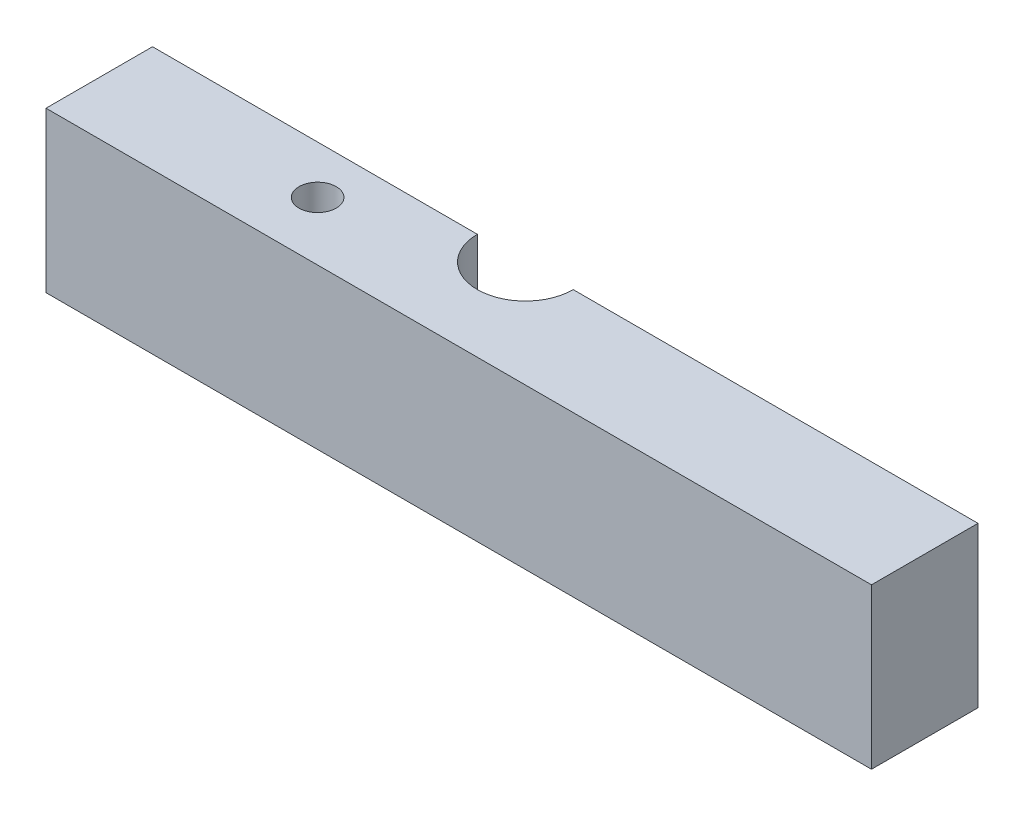
ISO-10303-21;
HEADER;
FILE_DESCRIPTION(('STEP AP214'),'2;1');
FILE_NAME('part.step','',(''),(''),'','','');
FILE_SCHEMA(('AUTOMOTIVE_DESIGN { 1 0 10303 214 1 1 1 1 }'));
ENDSEC;
DATA;
#1=APPLICATION_CONTEXT('core data for automotive mechanical design processes');
#2=APPLICATION_PROTOCOL_DEFINITION('international standard','automotive_design',2000,#1);
#3=PRODUCT_CONTEXT('',#1,'mechanical');
#4=PRODUCT('Part','Part','',(#3));
#5=PRODUCT_RELATED_PRODUCT_CATEGORY('part','',(#4));
#6=PRODUCT_DEFINITION_FORMATION('','',#4);
#7=PRODUCT_DEFINITION_CONTEXT('part definition',#1,'design');
#8=PRODUCT_DEFINITION('design','',#6,#7);
#9=PRODUCT_DEFINITION_SHAPE('','',#8);
#10=(LENGTH_UNIT() NAMED_UNIT(*) SI_UNIT(.MILLI.,.METRE.));
#11=(NAMED_UNIT(*) PLANE_ANGLE_UNIT() SI_UNIT($,.RADIAN.));
#12=(NAMED_UNIT(*) SI_UNIT($,.STERADIAN.) SOLID_ANGLE_UNIT());
#13=UNCERTAINTY_MEASURE_WITH_UNIT(LENGTH_MEASURE(1.E-05),#10,'distance_accuracy_value','');
#14=(GEOMETRIC_REPRESENTATION_CONTEXT(3) GLOBAL_UNCERTAINTY_ASSIGNED_CONTEXT((#13)) GLOBAL_UNIT_ASSIGNED_CONTEXT((#10,
#11,#12)) REPRESENTATION_CONTEXT('',''));
#15=CARTESIAN_POINT('',(0.,0.,0.));
#16=DIRECTION('',(0.,0.,1.));
#17=DIRECTION('',(1.,0.,0.));
#18=AXIS2_PLACEMENT_3D('',#15,#16,#17);
#19=CARTESIAN_POINT('',(0.,30.,0.));
#20=DIRECTION('',(0.,1.,0.));
#21=DIRECTION('',(0.,0.,1.));
#22=AXIS2_PLACEMENT_3D('',#19,#20,#21);
#23=PLANE('',#22);
#24=CARTESIAN_POINT('',(-30.,30.,9.));
#25=DIRECTION('',(0.,-1.,0.));
#26=DIRECTION('',(0.,0.,-1.));
#27=AXIS2_PLACEMENT_3D('',#24,#25,#26);
#28=CIRCLE('',#27,3.5);
#29=CARTESIAN_POINT('',(-30.,30.,5.5));
#30=VERTEX_POINT('',#29);
#31=EDGE_CURVE('E110',#30,#30,#28,.T.);
#32=ORIENTED_EDGE('',*,*,#31,.T.);
#33=EDGE_LOOP('',(#32));
#34=FACE_BOUND('',#33,.T.);
#35=DIRECTION('',(-1.,0.,0.));
#36=VECTOR('',#35,1.);
#37=CARTESIAN_POINT('',(85.,30.,0.));
#38=LINE('',#37,#36);
#39=CARTESIAN_POINT('',(-9.,30.,0.));
#40=VERTEX_POINT('',#39);
#41=CARTESIAN_POINT('',(-70.,30.,0.));
#42=VERTEX_POINT('',#41);
#43=EDGE_CURVE('E64',#40,#42,#38,.T.);
#44=ORIENTED_EDGE('',*,*,#43,.T.);
#45=DIRECTION('',(0.,0.,1.));
#46=VECTOR('',#45,1.);
#47=CARTESIAN_POINT('',(-70.,30.,-20.));
#48=LINE('',#47,#46);
#49=CARTESIAN_POINT('',(-70.,30.,20.));
#50=VERTEX_POINT('',#49);
#51=EDGE_CURVE('E108',#42,#50,#48,.T.);
#52=ORIENTED_EDGE('',*,*,#51,.T.);
#53=DIRECTION('',(1.,0.,0.));
#54=VECTOR('',#53,1.);
#55=CARTESIAN_POINT('',(-70.,30.,20.));
#56=LINE('',#55,#54);
#57=CARTESIAN_POINT('',(85.,30.,20.));
#58=VERTEX_POINT('',#57);
#59=EDGE_CURVE('E156',#50,#58,#56,.T.);
#60=ORIENTED_EDGE('',*,*,#59,.T.);
#61=DIRECTION('',(0.,0.,-1.));
#62=VECTOR('',#61,1.);
#63=CARTESIAN_POINT('',(85.,30.,-20.));
#64=LINE('',#63,#62);
#65=CARTESIAN_POINT('',(85.,30.,0.));
#66=VERTEX_POINT('',#65);
#67=EDGE_CURVE('E127',#58,#66,#64,.T.);
#68=ORIENTED_EDGE('',*,*,#67,.T.);
#69=CARTESIAN_POINT('',(8.99999999999999,30.,0.));
#70=VERTEX_POINT('',#69);
#71=EDGE_CURVE('E142',#66,#70,#38,.T.);
#72=ORIENTED_EDGE('',*,*,#71,.T.);
#73=CARTESIAN_POINT('',(0.,30.,0.));
#74=DIRECTION('',(0.,1.,0.));
#75=DIRECTION('',(0.,0.,1.));
#76=AXIS2_PLACEMENT_3D('',#73,#74,#75);
#77=CIRCLE('',#76,9.);
#78=EDGE_CURVE('E117',#40,#70,#77,.T.);
#79=ORIENTED_EDGE('',*,*,#78,.F.);
#80=EDGE_LOOP('',(#44,#52,#60,#68,#72,#79));
#81=FACE_BOUND('',#80,.T.);
#82=ADVANCED_FACE('F41',(#34,#81),#23,.T.);
#83=CARTESIAN_POINT('',(0.,0.,0.));
#84=DIRECTION('',(0.,1.,0.));
#85=DIRECTION('',(0.,0.,1.));
#86=AXIS2_PLACEMENT_3D('',#83,#84,#85);
#87=PLANE('',#86);
#88=CARTESIAN_POINT('',(-30.,0.,9.));
#89=DIRECTION('',(0.,-1.,0.));
#90=DIRECTION('',(0.,0.,-1.));
#91=AXIS2_PLACEMENT_3D('',#88,#89,#90);
#92=CIRCLE('',#91,3.5);
#93=CARTESIAN_POINT('',(-30.,0.,5.5));
#94=VERTEX_POINT('',#93);
#95=EDGE_CURVE('E169',#94,#94,#92,.T.);
#96=ORIENTED_EDGE('',*,*,#95,.F.);
#97=EDGE_LOOP('',(#96));
#98=FACE_BOUND('',#97,.T.);
#99=DIRECTION('',(0.,0.,1.));
#100=VECTOR('',#99,1.);
#101=CARTESIAN_POINT('',(-70.,0.,-20.));
#102=LINE('',#101,#100);
#103=CARTESIAN_POINT('',(-70.,0.,0.));
#104=VERTEX_POINT('',#103);
#105=CARTESIAN_POINT('',(-70.,0.,20.));
#106=VERTEX_POINT('',#105);
#107=EDGE_CURVE('E106',#104,#106,#102,.T.);
#108=ORIENTED_EDGE('',*,*,#107,.F.);
#109=DIRECTION('',(1.,0.,0.));
#110=VECTOR('',#109,1.);
#111=CARTESIAN_POINT('',(-70.,0.,0.));
#112=LINE('',#111,#110);
#113=CARTESIAN_POINT('',(-8.99999999999999,0.,0.));
#114=VERTEX_POINT('',#113);
#115=EDGE_CURVE('E92',#104,#114,#112,.T.);
#116=ORIENTED_EDGE('',*,*,#115,.T.);
#117=CARTESIAN_POINT('',(0.,0.,0.));
#118=DIRECTION('',(0.,1.,0.));
#119=DIRECTION('',(0.,0.,1.));
#120=AXIS2_PLACEMENT_3D('',#117,#118,#119);
#121=CIRCLE('',#120,9.);
#122=CARTESIAN_POINT('',(9.,0.,0.));
#123=VERTEX_POINT('',#122);
#124=EDGE_CURVE('E124',#114,#123,#121,.T.);
#125=ORIENTED_EDGE('',*,*,#124,.T.);
#126=CARTESIAN_POINT('',(85.,0.,0.));
#127=VERTEX_POINT('',#126);
#128=EDGE_CURVE('E57',#123,#127,#112,.T.);
#129=ORIENTED_EDGE('',*,*,#128,.T.);
#130=DIRECTION('',(0.,0.,-1.));
#131=VECTOR('',#130,1.);
#132=CARTESIAN_POINT('',(85.,0.,-20.));
#133=LINE('',#132,#131);
#134=CARTESIAN_POINT('',(85.,0.,20.));
#135=VERTEX_POINT('',#134);
#136=EDGE_CURVE('E121',#135,#127,#133,.T.);
#137=ORIENTED_EDGE('',*,*,#136,.F.);
#138=DIRECTION('',(1.,0.,0.));
#139=VECTOR('',#138,1.);
#140=CARTESIAN_POINT('',(-70.,0.,20.));
#141=LINE('',#140,#139);
#142=EDGE_CURVE('E114',#106,#135,#141,.T.);
#143=ORIENTED_EDGE('',*,*,#142,.F.);
#144=EDGE_LOOP('',(#108,#116,#125,#129,#137,#143));
#145=FACE_BOUND('',#144,.T.);
#146=ADVANCED_FACE('F112',(#98,#145),#87,.F.);
#147=CARTESIAN_POINT('',(-70.,30.,-20.));
#148=DIRECTION('',(1.,0.,0.));
#149=DIRECTION('',(0.,0.,-1.));
#150=AXIS2_PLACEMENT_3D('',#147,#148,#149);
#151=PLANE('',#150);
#152=ORIENTED_EDGE('',*,*,#51,.F.);
#153=DIRECTION('',(0.,-1.,0.));
#154=VECTOR('',#153,1.);
#155=CARTESIAN_POINT('',(-70.,30.,0.));
#156=LINE('',#155,#154);
#157=EDGE_CURVE('E95',#42,#104,#156,.T.);
#158=ORIENTED_EDGE('',*,*,#157,.T.);
#159=ORIENTED_EDGE('',*,*,#107,.T.);
#160=DIRECTION('',(0.,-1.,0.));
#161=VECTOR('',#160,1.);
#162=CARTESIAN_POINT('',(-70.,30.,20.));
#163=LINE('',#162,#161);
#164=EDGE_CURVE('E137',#50,#106,#163,.T.);
#165=ORIENTED_EDGE('',*,*,#164,.F.);
#166=EDGE_LOOP('',(#152,#158,#159,#165));
#167=FACE_BOUND('',#166,.T.);
#168=ADVANCED_FACE('F43',(#167),#151,.F.);
#169=CARTESIAN_POINT('',(-70.,30.,20.));
#170=DIRECTION('',(0.,0.,-1.));
#171=DIRECTION('',(-1.,0.,0.));
#172=AXIS2_PLACEMENT_3D('',#169,#170,#171);
#173=PLANE('',#172);
#174=ORIENTED_EDGE('',*,*,#142,.T.);
#175=DIRECTION('',(0.,-1.,0.));
#176=VECTOR('',#175,1.);
#177=CARTESIAN_POINT('',(85.,30.,20.));
#178=LINE('',#177,#176);
#179=EDGE_CURVE('E133',#58,#135,#178,.T.);
#180=ORIENTED_EDGE('',*,*,#179,.F.);
#181=ORIENTED_EDGE('',*,*,#59,.F.);
#182=ORIENTED_EDGE('',*,*,#164,.T.);
#183=EDGE_LOOP('',(#174,#180,#181,#182));
#184=FACE_BOUND('',#183,.T.);
#185=ADVANCED_FACE('F162',(#184),#173,.F.);
#186=CARTESIAN_POINT('',(85.,30.,-20.));
#187=DIRECTION('',(-1.,0.,0.));
#188=DIRECTION('',(0.,0.,1.));
#189=AXIS2_PLACEMENT_3D('',#186,#187,#188);
#190=PLANE('',#189);
#191=ORIENTED_EDGE('',*,*,#136,.T.);
#192=DIRECTION('',(0.,1.,0.));
#193=VECTOR('',#192,1.);
#194=CARTESIAN_POINT('',(85.,0.,0.));
#195=LINE('',#194,#193);
#196=EDGE_CURVE('E101',#127,#66,#195,.T.);
#197=ORIENTED_EDGE('',*,*,#196,.T.);
#198=ORIENTED_EDGE('',*,*,#67,.F.);
#199=ORIENTED_EDGE('',*,*,#179,.T.);
#200=EDGE_LOOP('',(#191,#197,#198,#199));
#201=FACE_BOUND('',#200,.T.);
#202=ADVANCED_FACE('F164',(#201),#190,.F.);
#203=CARTESIAN_POINT('',(0.,30.,0.));
#204=DIRECTION('',(0.,-1.,0.));
#205=DIRECTION('',(0.,0.,-1.));
#206=AXIS2_PLACEMENT_3D('',#203,#204,#205);
#207=CYLINDRICAL_SURFACE('',#206,9.);
#208=DIRECTION('',(0.,-1.,0.));
#209=VECTOR('',#208,1.);
#210=CARTESIAN_POINT('',(-9.,30.,0.));
#211=LINE('',#210,#209);
#212=EDGE_CURVE('E11',#40,#114,#211,.T.);
#213=ORIENTED_EDGE('',*,*,#212,.F.);
#214=ORIENTED_EDGE('',*,*,#78,.T.);
#215=DIRECTION('',(0.,-1.,0.));
#216=VECTOR('',#215,1.);
#217=CARTESIAN_POINT('',(9.,30.,0.));
#218=LINE('',#217,#216);
#219=EDGE_CURVE('E50',#123,#70,#218,.F.);
#220=ORIENTED_EDGE('',*,*,#219,.F.);
#221=ORIENTED_EDGE('',*,*,#124,.F.);
#222=EDGE_LOOP('',(#213,#214,#220,#221));
#223=FACE_BOUND('',#222,.T.);
#224=ADVANCED_FACE('F151',(#223),#207,.F.);
#225=CARTESIAN_POINT('',(0.,0.,0.));
#226=DIRECTION('',(0.,0.,1.));
#227=DIRECTION('',(1.,0.,0.));
#228=AXIS2_PLACEMENT_3D('',#225,#226,#227);
#229=PLANE('',#228);
#230=ORIENTED_EDGE('',*,*,#219,.T.);
#231=ORIENTED_EDGE('',*,*,#71,.F.);
#232=ORIENTED_EDGE('',*,*,#196,.F.);
#233=ORIENTED_EDGE('',*,*,#128,.F.);
#234=EDGE_LOOP('',(#230,#231,#232,#233));
#235=FACE_BOUND('',#234,.T.);
#236=ADVANCED_FACE('F141',(#235),#229,.F.);
#237=ORIENTED_EDGE('',*,*,#212,.T.);
#238=ORIENTED_EDGE('',*,*,#115,.F.);
#239=ORIENTED_EDGE('',*,*,#157,.F.);
#240=ORIENTED_EDGE('',*,*,#43,.F.);
#241=EDGE_LOOP('',(#237,#238,#239,#240));
#242=FACE_BOUND('',#241,.T.);
#243=ADVANCED_FACE('F94',(#242),#229,.F.);
#244=CARTESIAN_POINT('',(-30.,30.,9.));
#245=DIRECTION('',(0.,-1.,0.));
#246=DIRECTION('',(0.,0.,-1.));
#247=AXIS2_PLACEMENT_3D('',#244,#245,#246);
#248=CYLINDRICAL_SURFACE('',#247,3.5);
#249=ORIENTED_EDGE('',*,*,#31,.F.);
#250=EDGE_LOOP('',(#249));
#251=FACE_BOUND('',#250,.T.);
#252=ORIENTED_EDGE('',*,*,#95,.T.);
#253=EDGE_LOOP('',(#252));
#254=FACE_BOUND('',#253,.T.);
#255=ADVANCED_FACE('F178',(#251,#254),#248,.F.);
#256=CLOSED_SHELL('',(#82,#146,#168,#185,#202,#224,#236,#243,#255));
#257=MANIFOLD_SOLID_BREP('B2',#256);
#258=ADVANCED_BREP_SHAPE_REPRESENTATION('',(#18,#257),#14);
#259=SHAPE_DEFINITION_REPRESENTATION(#9,#258);
ENDSEC;
END-ISO-10303-21;
